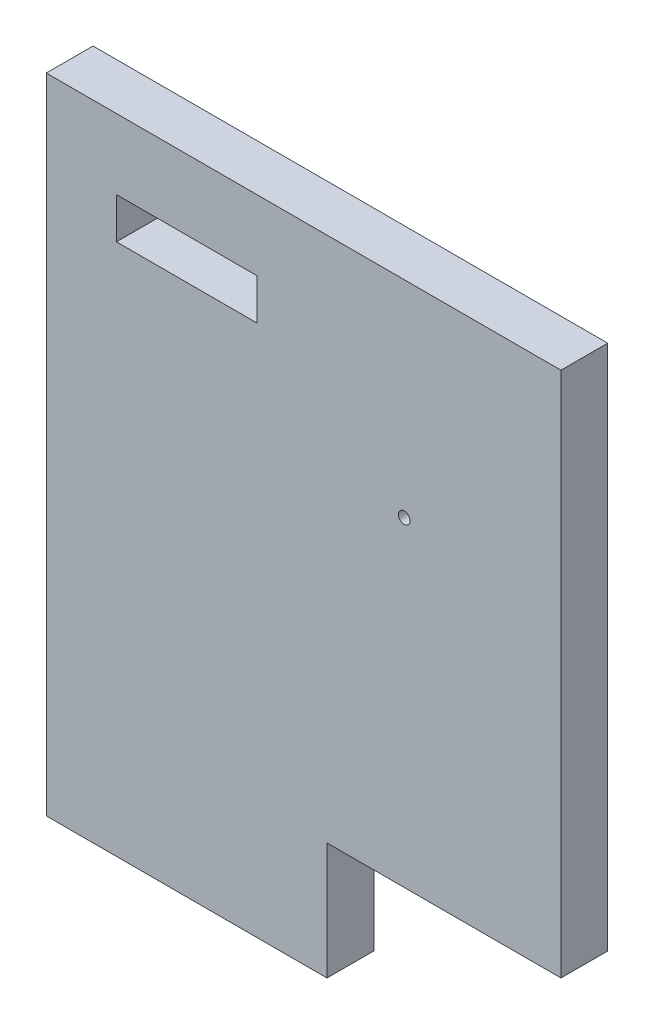
ISO-10303-21;
HEADER;
FILE_DESCRIPTION(('STEP AP214'),'2;1');
FILE_NAME('part.step','',(''),(''),'','','');
FILE_SCHEMA(('AUTOMOTIVE_DESIGN { 1 0 10303 214 1 1 1 1 }'));
ENDSEC;
DATA;
#1=APPLICATION_CONTEXT('core data for automotive mechanical design processes');
#2=APPLICATION_PROTOCOL_DEFINITION('international standard','automotive_design',2000,#1);
#3=PRODUCT_CONTEXT('',#1,'mechanical');
#4=PRODUCT('Part','Part','',(#3));
#5=PRODUCT_RELATED_PRODUCT_CATEGORY('part','',(#4));
#6=PRODUCT_DEFINITION_FORMATION('','',#4);
#7=PRODUCT_DEFINITION_CONTEXT('part definition',#1,'design');
#8=PRODUCT_DEFINITION('design','',#6,#7);
#9=PRODUCT_DEFINITION_SHAPE('','',#8);
#10=(LENGTH_UNIT() NAMED_UNIT(*) SI_UNIT(.MILLI.,.METRE.));
#11=(NAMED_UNIT(*) PLANE_ANGLE_UNIT() SI_UNIT($,.RADIAN.));
#12=(NAMED_UNIT(*) SI_UNIT($,.STERADIAN.) SOLID_ANGLE_UNIT());
#13=UNCERTAINTY_MEASURE_WITH_UNIT(LENGTH_MEASURE(1.E-05),#10,'distance_accuracy_value','');
#14=(GEOMETRIC_REPRESENTATION_CONTEXT(3) GLOBAL_UNCERTAINTY_ASSIGNED_CONTEXT((#13)) GLOBAL_UNIT_ASSIGNED_CONTEXT((#10,
#11,#12)) REPRESENTATION_CONTEXT('',''));
#15=CARTESIAN_POINT('',(0.,0.,0.));
#16=DIRECTION('',(0.,0.,1.));
#17=DIRECTION('',(1.,0.,0.));
#18=AXIS2_PLACEMENT_3D('',#15,#16,#17);
#19=CARTESIAN_POINT('',(0.,0.,4.));
#20=DIRECTION('',(0.,0.,-1.));
#21=DIRECTION('',(-1.,0.,0.));
#22=AXIS2_PLACEMENT_3D('',#19,#20,#21);
#23=PLANE('',#22);
#24=CARTESIAN_POINT('',(30.5999999999969,37.3775926730768,4.));
#25=DIRECTION('',(0.,0.,1.));
#26=DIRECTION('',(1.,0.,0.));
#27=AXIS2_PLACEMENT_3D('',#24,#25,#26);
#28=CIRCLE('',#27,0.499999999999999);
#29=CARTESIAN_POINT('',(31.0999999999969,37.3775926730768,4.));
#30=VERTEX_POINT('',#29);
#31=EDGE_CURVE('E203',#30,#30,#28,.T.);
#32=ORIENTED_EDGE('',*,*,#31,.F.);
#33=EDGE_LOOP('',(#32));
#34=FACE_BOUND('',#33,.T.);
#35=DIRECTION('',(0.,-1.,0.));
#36=VECTOR('',#35,1.);
#37=CARTESIAN_POINT('',(0.,0.,4.));
#38=LINE('',#37,#36);
#39=CARTESIAN_POINT('',(0.,55.,4.));
#40=VERTEX_POINT('',#39);
#41=CARTESIAN_POINT('',(0.,0.,4.));
#42=VERTEX_POINT('',#41);
#43=EDGE_CURVE('E169',#40,#42,#38,.T.);
#44=ORIENTED_EDGE('',*,*,#43,.T.);
#45=DIRECTION('',(1.,0.,0.));
#46=VECTOR('',#45,1.);
#47=CARTESIAN_POINT('',(0.,0.,4.));
#48=LINE('',#47,#46);
#49=CARTESIAN_POINT('',(24.,0.,4.));
#50=VERTEX_POINT('',#49);
#51=EDGE_CURVE('E172',#42,#50,#48,.T.);
#52=ORIENTED_EDGE('',*,*,#51,.T.);
#53=DIRECTION('',(0.,1.,0.));
#54=VECTOR('',#53,1.);
#55=CARTESIAN_POINT('',(24.,0.,4.));
#56=LINE('',#55,#54);
#57=CARTESIAN_POINT('',(24.,10.,4.));
#58=VERTEX_POINT('',#57);
#59=EDGE_CURVE('E174',#50,#58,#56,.T.);
#60=ORIENTED_EDGE('',*,*,#59,.T.);
#61=DIRECTION('',(1.,0.,0.));
#62=VECTOR('',#61,1.);
#63=CARTESIAN_POINT('',(44.,10.,4.));
#64=LINE('',#63,#62);
#65=CARTESIAN_POINT('',(44.,10.,4.));
#66=VERTEX_POINT('',#65);
#67=EDGE_CURVE('E48',#58,#66,#64,.T.);
#68=ORIENTED_EDGE('',*,*,#67,.T.);
#69=DIRECTION('',(0.,1.,0.));
#70=VECTOR('',#69,1.);
#71=CARTESIAN_POINT('',(44.,55.,4.));
#72=LINE('',#71,#70);
#73=CARTESIAN_POINT('',(44.,55.,4.));
#74=VERTEX_POINT('',#73);
#75=EDGE_CURVE('E128',#66,#74,#72,.T.);
#76=ORIENTED_EDGE('',*,*,#75,.T.);
#77=DIRECTION('',(-1.,0.,0.));
#78=VECTOR('',#77,1.);
#79=CARTESIAN_POINT('',(0.,55.,4.));
#80=LINE('',#79,#78);
#81=EDGE_CURVE('E177',#74,#40,#80,.T.);
#82=ORIENTED_EDGE('',*,*,#81,.T.);
#83=EDGE_LOOP('',(#44,#52,#60,#68,#76,#82));
#84=FACE_BOUND('',#83,.T.);
#85=DIRECTION('',(0.,-1.,0.));
#86=VECTOR('',#85,1.);
#87=CARTESIAN_POINT('',(6.,49.,4.));
#88=LINE('',#87,#86);
#89=CARTESIAN_POINT('',(6.,49.,4.));
#90=VERTEX_POINT('',#89);
#91=CARTESIAN_POINT('',(6.,45.5,4.));
#92=VERTEX_POINT('',#91);
#93=EDGE_CURVE('E140',#90,#92,#88,.T.);
#94=ORIENTED_EDGE('',*,*,#93,.F.);
#95=DIRECTION('',(-1.,0.,0.));
#96=VECTOR('',#95,1.);
#97=CARTESIAN_POINT('',(6.,49.,4.));
#98=LINE('',#97,#96);
#99=CARTESIAN_POINT('',(18.,49.,4.));
#100=VERTEX_POINT('',#99);
#101=EDGE_CURVE('E147',#100,#90,#98,.T.);
#102=ORIENTED_EDGE('',*,*,#101,.F.);
#103=DIRECTION('',(0.,1.,0.));
#104=VECTOR('',#103,1.);
#105=CARTESIAN_POINT('',(18.,49.,4.));
#106=LINE('',#105,#104);
#107=CARTESIAN_POINT('',(18.,45.5,4.));
#108=VERTEX_POINT('',#107);
#109=EDGE_CURVE('E145',#108,#100,#106,.T.);
#110=ORIENTED_EDGE('',*,*,#109,.F.);
#111=DIRECTION('',(1.,0.,0.));
#112=VECTOR('',#111,1.);
#113=CARTESIAN_POINT('',(6.,45.5,4.));
#114=LINE('',#113,#112);
#115=EDGE_CURVE('E142',#92,#108,#114,.T.);
#116=ORIENTED_EDGE('',*,*,#115,.F.);
#117=EDGE_LOOP('',(#94,#102,#110,#116));
#118=FACE_BOUND('',#117,.T.);
#119=ADVANCED_FACE('F33',(#34,#84,#118),#23,.F.);
#120=CARTESIAN_POINT('',(0.,0.,0.));
#121=DIRECTION('',(0.,0.,-1.));
#122=DIRECTION('',(-1.,0.,0.));
#123=AXIS2_PLACEMENT_3D('',#120,#121,#122);
#124=PLANE('',#123);
#125=CARTESIAN_POINT('',(30.5999999999969,37.3775926730768,0.));
#126=DIRECTION('',(0.,0.,-1.));
#127=DIRECTION('',(-1.,0.,0.));
#128=AXIS2_PLACEMENT_3D('',#125,#126,#127);
#129=CIRCLE('',#128,0.499999999999999);
#130=CARTESIAN_POINT('',(30.0999999999969,37.3775926730768,0.));
#131=VERTEX_POINT('',#130);
#132=EDGE_CURVE('E205',#131,#131,#129,.F.);
#133=ORIENTED_EDGE('',*,*,#132,.T.);
#134=EDGE_LOOP('',(#133));
#135=FACE_BOUND('',#134,.T.);
#136=DIRECTION('',(0.,-1.,0.));
#137=VECTOR('',#136,1.);
#138=CARTESIAN_POINT('',(0.,0.,0.));
#139=LINE('',#138,#137);
#140=CARTESIAN_POINT('',(0.,55.,0.));
#141=VERTEX_POINT('',#140);
#142=CARTESIAN_POINT('',(0.,0.,0.));
#143=VERTEX_POINT('',#142);
#144=EDGE_CURVE('E168',#141,#143,#139,.T.);
#145=ORIENTED_EDGE('',*,*,#144,.F.);
#146=DIRECTION('',(-1.,0.,0.));
#147=VECTOR('',#146,1.);
#148=CARTESIAN_POINT('',(0.,55.,0.));
#149=LINE('',#148,#147);
#150=CARTESIAN_POINT('',(44.,55.,0.));
#151=VERTEX_POINT('',#150);
#152=EDGE_CURVE('E118',#151,#141,#149,.T.);
#153=ORIENTED_EDGE('',*,*,#152,.F.);
#154=DIRECTION('',(0.,1.,0.));
#155=VECTOR('',#154,1.);
#156=CARTESIAN_POINT('',(44.,55.,0.));
#157=LINE('',#156,#155);
#158=CARTESIAN_POINT('',(44.,10.,0.));
#159=VERTEX_POINT('',#158);
#160=EDGE_CURVE('E110',#159,#151,#157,.T.);
#161=ORIENTED_EDGE('',*,*,#160,.F.);
#162=DIRECTION('',(1.,0.,0.));
#163=VECTOR('',#162,1.);
#164=CARTESIAN_POINT('',(44.,10.,0.));
#165=LINE('',#164,#163);
#166=CARTESIAN_POINT('',(24.,10.,0.));
#167=VERTEX_POINT('',#166);
#168=EDGE_CURVE('E117',#167,#159,#165,.T.);
#169=ORIENTED_EDGE('',*,*,#168,.F.);
#170=DIRECTION('',(0.,1.,0.));
#171=VECTOR('',#170,1.);
#172=CARTESIAN_POINT('',(24.,0.,0.));
#173=LINE('',#172,#171);
#174=CARTESIAN_POINT('',(24.,0.,0.));
#175=VERTEX_POINT('',#174);
#176=EDGE_CURVE('E184',#175,#167,#173,.T.);
#177=ORIENTED_EDGE('',*,*,#176,.F.);
#178=DIRECTION('',(1.,0.,0.));
#179=VECTOR('',#178,1.);
#180=CARTESIAN_POINT('',(0.,0.,0.));
#181=LINE('',#180,#179);
#182=EDGE_CURVE('E182',#143,#175,#181,.T.);
#183=ORIENTED_EDGE('',*,*,#182,.F.);
#184=EDGE_LOOP('',(#145,#153,#161,#169,#177,#183));
#185=FACE_BOUND('',#184,.T.);
#186=DIRECTION('',(-1.,0.,0.));
#187=VECTOR('',#186,1.);
#188=CARTESIAN_POINT('',(6.,49.,0.));
#189=LINE('',#188,#187);
#190=CARTESIAN_POINT('',(18.,49.,0.));
#191=VERTEX_POINT('',#190);
#192=CARTESIAN_POINT('',(6.,49.,0.));
#193=VERTEX_POINT('',#192);
#194=EDGE_CURVE('E143',#191,#193,#189,.T.);
#195=ORIENTED_EDGE('',*,*,#194,.T.);
#196=DIRECTION('',(0.,-1.,0.));
#197=VECTOR('',#196,1.);
#198=CARTESIAN_POINT('',(6.,49.,0.));
#199=LINE('',#198,#197);
#200=CARTESIAN_POINT('',(6.,45.5,0.));
#201=VERTEX_POINT('',#200);
#202=EDGE_CURVE('E139',#193,#201,#199,.T.);
#203=ORIENTED_EDGE('',*,*,#202,.T.);
#204=DIRECTION('',(1.,0.,0.));
#205=VECTOR('',#204,1.);
#206=CARTESIAN_POINT('',(6.,45.5,0.));
#207=LINE('',#206,#205);
#208=CARTESIAN_POINT('',(18.,45.5,0.));
#209=VERTEX_POINT('',#208);
#210=EDGE_CURVE('E152',#201,#209,#207,.T.);
#211=ORIENTED_EDGE('',*,*,#210,.T.);
#212=DIRECTION('',(0.,1.,0.));
#213=VECTOR('',#212,1.);
#214=CARTESIAN_POINT('',(18.,49.,0.));
#215=LINE('',#214,#213);
#216=EDGE_CURVE('E155',#209,#191,#215,.T.);
#217=ORIENTED_EDGE('',*,*,#216,.T.);
#218=EDGE_LOOP('',(#195,#203,#211,#217));
#219=FACE_BOUND('',#218,.T.);
#220=ADVANCED_FACE('F113',(#135,#185,#219),#124,.T.);
#221=CARTESIAN_POINT('',(0.,0.,4.));
#222=DIRECTION('',(1.,0.,0.));
#223=DIRECTION('',(0.,0.,-1.));
#224=AXIS2_PLACEMENT_3D('',#221,#222,#223);
#225=PLANE('',#224);
#226=ORIENTED_EDGE('',*,*,#144,.T.);
#227=DIRECTION('',(0.,0.,-1.));
#228=VECTOR('',#227,1.);
#229=CARTESIAN_POINT('',(0.,0.,4.));
#230=LINE('',#229,#228);
#231=EDGE_CURVE('E11',#42,#143,#230,.T.);
#232=ORIENTED_EDGE('',*,*,#231,.F.);
#233=ORIENTED_EDGE('',*,*,#43,.F.);
#234=DIRECTION('',(0.,0.,-1.));
#235=VECTOR('',#234,1.);
#236=CARTESIAN_POINT('',(0.,55.,4.));
#237=LINE('',#236,#235);
#238=EDGE_CURVE('E179',#40,#141,#237,.T.);
#239=ORIENTED_EDGE('',*,*,#238,.T.);
#240=EDGE_LOOP('',(#226,#232,#233,#239));
#241=FACE_BOUND('',#240,.T.);
#242=ADVANCED_FACE('F35',(#241),#225,.F.);
#243=CARTESIAN_POINT('',(0.,0.,4.));
#244=DIRECTION('',(0.,1.,0.));
#245=DIRECTION('',(0.,0.,1.));
#246=AXIS2_PLACEMENT_3D('',#243,#244,#245);
#247=PLANE('',#246);
#248=ORIENTED_EDGE('',*,*,#182,.T.);
#249=DIRECTION('',(0.,0.,-1.));
#250=VECTOR('',#249,1.);
#251=CARTESIAN_POINT('',(24.,0.,4.));
#252=LINE('',#251,#250);
#253=EDGE_CURVE('E41',#50,#175,#252,.T.);
#254=ORIENTED_EDGE('',*,*,#253,.F.);
#255=ORIENTED_EDGE('',*,*,#51,.F.);
#256=ORIENTED_EDGE('',*,*,#231,.T.);
#257=EDGE_LOOP('',(#248,#254,#255,#256));
#258=FACE_BOUND('',#257,.T.);
#259=ADVANCED_FACE('F195',(#258),#247,.F.);
#260=CARTESIAN_POINT('',(24.,0.,4.));
#261=DIRECTION('',(-1.,0.,0.));
#262=DIRECTION('',(0.,0.,1.));
#263=AXIS2_PLACEMENT_3D('',#260,#261,#262);
#264=PLANE('',#263);
#265=ORIENTED_EDGE('',*,*,#176,.T.);
#266=DIRECTION('',(0.,0.,1.));
#267=VECTOR('',#266,1.);
#268=CARTESIAN_POINT('',(24.,10.,-49.2442890089805));
#269=LINE('',#268,#267);
#270=EDGE_CURVE('E131',#167,#58,#269,.T.);
#271=ORIENTED_EDGE('',*,*,#270,.T.);
#272=ORIENTED_EDGE('',*,*,#59,.F.);
#273=ORIENTED_EDGE('',*,*,#253,.T.);
#274=EDGE_LOOP('',(#265,#271,#272,#273));
#275=FACE_BOUND('',#274,.T.);
#276=ADVANCED_FACE('F192',(#275),#264,.F.);
#277=CARTESIAN_POINT('',(0.,55.,4.));
#278=DIRECTION('',(0.,-1.,0.));
#279=DIRECTION('',(0.,0.,-1.));
#280=AXIS2_PLACEMENT_3D('',#277,#278,#279);
#281=PLANE('',#280);
#282=ORIENTED_EDGE('',*,*,#152,.T.);
#283=ORIENTED_EDGE('',*,*,#238,.F.);
#284=ORIENTED_EDGE('',*,*,#81,.F.);
#285=DIRECTION('',(0.,0.,1.));
#286=VECTOR('',#285,1.);
#287=CARTESIAN_POINT('',(44.,55.,-49.2442890089805));
#288=LINE('',#287,#286);
#289=EDGE_CURVE('E122',#151,#74,#288,.T.);
#290=ORIENTED_EDGE('',*,*,#289,.F.);
#291=EDGE_LOOP('',(#282,#283,#284,#290));
#292=FACE_BOUND('',#291,.T.);
#293=ADVANCED_FACE('F200',(#292),#281,.F.);
#294=CARTESIAN_POINT('',(6.,49.,4.));
#295=DIRECTION('',(1.,0.,0.));
#296=DIRECTION('',(0.,0.,-1.));
#297=AXIS2_PLACEMENT_3D('',#294,#295,#296);
#298=PLANE('',#297);
#299=ORIENTED_EDGE('',*,*,#202,.F.);
#300=DIRECTION('',(0.,0.,-1.));
#301=VECTOR('',#300,1.);
#302=CARTESIAN_POINT('',(6.,49.,4.));
#303=LINE('',#302,#301);
#304=EDGE_CURVE('E149',#90,#193,#303,.T.);
#305=ORIENTED_EDGE('',*,*,#304,.F.);
#306=ORIENTED_EDGE('',*,*,#93,.T.);
#307=DIRECTION('',(0.,0.,-1.));
#308=VECTOR('',#307,1.);
#309=CARTESIAN_POINT('',(6.,45.5,4.));
#310=LINE('',#309,#308);
#311=EDGE_CURVE('E165',#92,#201,#310,.T.);
#312=ORIENTED_EDGE('',*,*,#311,.T.);
#313=EDGE_LOOP('',(#299,#305,#306,#312));
#314=FACE_BOUND('',#313,.T.);
#315=ADVANCED_FACE('F229',(#314),#298,.T.);
#316=CARTESIAN_POINT('',(6.,45.5,4.));
#317=DIRECTION('',(0.,1.,0.));
#318=DIRECTION('',(0.,0.,1.));
#319=AXIS2_PLACEMENT_3D('',#316,#317,#318);
#320=PLANE('',#319);
#321=ORIENTED_EDGE('',*,*,#210,.F.);
#322=ORIENTED_EDGE('',*,*,#311,.F.);
#323=ORIENTED_EDGE('',*,*,#115,.T.);
#324=DIRECTION('',(0.,0.,-1.));
#325=VECTOR('',#324,1.);
#326=CARTESIAN_POINT('',(18.,45.5,4.));
#327=LINE('',#326,#325);
#328=EDGE_CURVE('E163',#108,#209,#327,.T.);
#329=ORIENTED_EDGE('',*,*,#328,.T.);
#330=EDGE_LOOP('',(#321,#322,#323,#329));
#331=FACE_BOUND('',#330,.T.);
#332=ADVANCED_FACE('F301',(#331),#320,.T.);
#333=CARTESIAN_POINT('',(18.,49.,4.));
#334=DIRECTION('',(-1.,0.,0.));
#335=DIRECTION('',(0.,0.,1.));
#336=AXIS2_PLACEMENT_3D('',#333,#334,#335);
#337=PLANE('',#336);
#338=ORIENTED_EDGE('',*,*,#216,.F.);
#339=ORIENTED_EDGE('',*,*,#328,.F.);
#340=ORIENTED_EDGE('',*,*,#109,.T.);
#341=DIRECTION('',(0.,0.,-1.));
#342=VECTOR('',#341,1.);
#343=CARTESIAN_POINT('',(18.,49.,4.));
#344=LINE('',#343,#342);
#345=EDGE_CURVE('E56',#100,#191,#344,.T.);
#346=ORIENTED_EDGE('',*,*,#345,.T.);
#347=EDGE_LOOP('',(#338,#339,#340,#346));
#348=FACE_BOUND('',#347,.T.);
#349=ADVANCED_FACE('F292',(#348),#337,.T.);
#350=CARTESIAN_POINT('',(6.,49.,4.));
#351=DIRECTION('',(0.,-1.,0.));
#352=DIRECTION('',(0.,0.,-1.));
#353=AXIS2_PLACEMENT_3D('',#350,#351,#352);
#354=PLANE('',#353);
#355=ORIENTED_EDGE('',*,*,#194,.F.);
#356=ORIENTED_EDGE('',*,*,#345,.F.);
#357=ORIENTED_EDGE('',*,*,#101,.T.);
#358=ORIENTED_EDGE('',*,*,#304,.T.);
#359=EDGE_LOOP('',(#355,#356,#357,#358));
#360=FACE_BOUND('',#359,.T.);
#361=ADVANCED_FACE('F267',(#360),#354,.T.);
#362=CARTESIAN_POINT('',(44.,10.,-49.2442890089805));
#363=DIRECTION('',(0.,-1.,0.));
#364=DIRECTION('',(0.,0.,-1.));
#365=AXIS2_PLACEMENT_3D('',#362,#363,#364);
#366=PLANE('',#365);
#367=ORIENTED_EDGE('',*,*,#270,.F.);
#368=ORIENTED_EDGE('',*,*,#168,.T.);
#369=DIRECTION('',(0.,0.,1.));
#370=VECTOR('',#369,1.);
#371=CARTESIAN_POINT('',(44.,10.,-49.2442890089805));
#372=LINE('',#371,#370);
#373=EDGE_CURVE('E123',#159,#66,#372,.T.);
#374=ORIENTED_EDGE('',*,*,#373,.T.);
#375=ORIENTED_EDGE('',*,*,#67,.F.);
#376=EDGE_LOOP('',(#367,#368,#374,#375));
#377=FACE_BOUND('',#376,.T.);
#378=ADVANCED_FACE('F130',(#377),#366,.T.);
#379=CARTESIAN_POINT('',(44.,55.,-49.2442890089805));
#380=DIRECTION('',(1.,0.,0.));
#381=DIRECTION('',(0.,1.,0.));
#382=AXIS2_PLACEMENT_3D('',#379,#380,#381);
#383=PLANE('',#382);
#384=ORIENTED_EDGE('',*,*,#373,.F.);
#385=ORIENTED_EDGE('',*,*,#160,.T.);
#386=ORIENTED_EDGE('',*,*,#289,.T.);
#387=ORIENTED_EDGE('',*,*,#75,.F.);
#388=EDGE_LOOP('',(#384,#385,#386,#387));
#389=FACE_BOUND('',#388,.T.);
#390=ADVANCED_FACE('F126',(#389),#383,.T.);
#391=CARTESIAN_POINT('',(30.5999999999969,37.3775926730768,-0.00100000000000013));
#392=DIRECTION('',(0.,0.,1.));
#393=DIRECTION('',(1.,0.,0.));
#394=AXIS2_PLACEMENT_3D('',#391,#392,#393);
#395=CYLINDRICAL_SURFACE('',#394,0.499999999999999);
#396=ORIENTED_EDGE('',*,*,#132,.F.);
#397=EDGE_LOOP('',(#396));
#398=FACE_BOUND('',#397,.T.);
#399=ORIENTED_EDGE('',*,*,#31,.T.);
#400=EDGE_LOOP('',(#399));
#401=FACE_BOUND('',#400,.T.);
#402=ADVANCED_FACE('F214',(#398,#401),#395,.F.);
#403=CLOSED_SHELL('',(#119,#220,#242,#259,#276,#293,#315,#332,#349,#361,#378,#390,#402));
#404=MANIFOLD_SOLID_BREP('B2',#403);
#405=ADVANCED_BREP_SHAPE_REPRESENTATION('',(#18,#404),#14);
#406=SHAPE_DEFINITION_REPRESENTATION(#9,#405);
ENDSEC;
END-ISO-10303-21;
